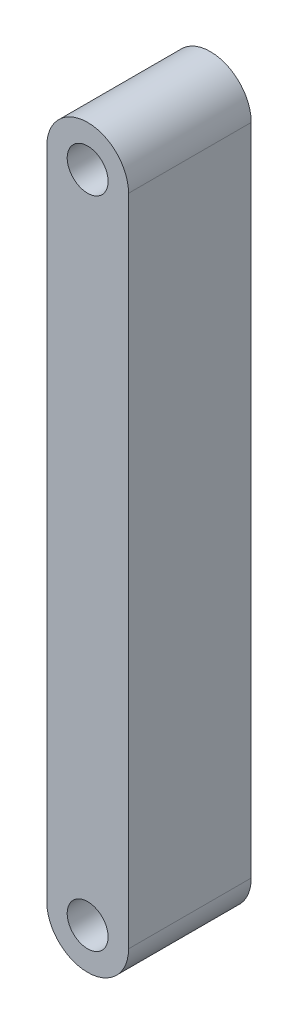
ISO-10303-21;
HEADER;
FILE_DESCRIPTION(('STEP AP214'),'2;1');
FILE_NAME('part.step','',(''),(''),'','','');
FILE_SCHEMA(('AUTOMOTIVE_DESIGN { 1 0 10303 214 1 1 1 1 }'));
ENDSEC;
DATA;
#1=APPLICATION_CONTEXT('core data for automotive mechanical design processes');
#2=APPLICATION_PROTOCOL_DEFINITION('international standard','automotive_design',2000,#1);
#3=PRODUCT_CONTEXT('',#1,'mechanical');
#4=PRODUCT('Part','Part','',(#3));
#5=PRODUCT_RELATED_PRODUCT_CATEGORY('part','',(#4));
#6=PRODUCT_DEFINITION_FORMATION('','',#4);
#7=PRODUCT_DEFINITION_CONTEXT('part definition',#1,'design');
#8=PRODUCT_DEFINITION('design','',#6,#7);
#9=PRODUCT_DEFINITION_SHAPE('','',#8);
#10=(LENGTH_UNIT() NAMED_UNIT(*) SI_UNIT(.MILLI.,.METRE.));
#11=(NAMED_UNIT(*) PLANE_ANGLE_UNIT() SI_UNIT($,.RADIAN.));
#12=(NAMED_UNIT(*) SI_UNIT($,.STERADIAN.) SOLID_ANGLE_UNIT());
#13=UNCERTAINTY_MEASURE_WITH_UNIT(LENGTH_MEASURE(1.E-05),#10,'distance_accuracy_value','');
#14=(GEOMETRIC_REPRESENTATION_CONTEXT(3) GLOBAL_UNCERTAINTY_ASSIGNED_CONTEXT((#13)) GLOBAL_UNIT_ASSIGNED_CONTEXT((#10,
#11,#12)) REPRESENTATION_CONTEXT('',''));
#15=CARTESIAN_POINT('',(0.,0.,0.));
#16=DIRECTION('',(0.,0.,1.));
#17=DIRECTION('',(1.,0.,0.));
#18=AXIS2_PLACEMENT_3D('',#15,#16,#17);
#19=CARTESIAN_POINT('',(0.,-40.,15.));
#20=DIRECTION('',(0.,0.,-1.));
#21=DIRECTION('',(-1.,0.,0.));
#22=AXIS2_PLACEMENT_3D('',#19,#20,#21);
#23=CYLINDRICAL_SURFACE('',#22,5.);
#24=CARTESIAN_POINT('',(0.,-40.,0.));
#25=DIRECTION('',(0.,0.,1.));
#26=DIRECTION('',(1.,0.,0.));
#27=AXIS2_PLACEMENT_3D('',#24,#25,#26);
#28=CIRCLE('',#27,5.);
#29=CARTESIAN_POINT('',(-5.,-40.,0.));
#30=VERTEX_POINT('',#29);
#31=CARTESIAN_POINT('',(5.,-40.,0.));
#32=VERTEX_POINT('',#31);
#33=EDGE_CURVE('E111',#30,#32,#28,.T.);
#34=ORIENTED_EDGE('',*,*,#33,.T.);
#35=DIRECTION('',(0.,0.,-1.));
#36=VECTOR('',#35,1.);
#37=CARTESIAN_POINT('',(5.,-40.,15.));
#38=LINE('',#37,#36);
#39=CARTESIAN_POINT('',(5.,-40.,15.));
#40=VERTEX_POINT('',#39);
#41=EDGE_CURVE('E11',#40,#32,#38,.T.);
#42=ORIENTED_EDGE('',*,*,#41,.F.);
#43=CARTESIAN_POINT('',(0.,-40.,15.));
#44=DIRECTION('',(0.,0.,1.));
#45=DIRECTION('',(1.,0.,0.));
#46=AXIS2_PLACEMENT_3D('',#43,#44,#45);
#47=CIRCLE('',#46,5.);
#48=CARTESIAN_POINT('',(-5.,-40.,15.));
#49=VERTEX_POINT('',#48);
#50=EDGE_CURVE('E84',#49,#40,#47,.T.);
#51=ORIENTED_EDGE('',*,*,#50,.F.);
#52=DIRECTION('',(0.,0.,-1.));
#53=VECTOR('',#52,1.);
#54=CARTESIAN_POINT('',(-5.,-40.,15.));
#55=LINE('',#54,#53);
#56=EDGE_CURVE('E110',#49,#30,#55,.T.);
#57=ORIENTED_EDGE('',*,*,#56,.T.);
#58=EDGE_LOOP('',(#34,#42,#51,#57));
#59=FACE_BOUND('',#58,.T.);
#60=ADVANCED_FACE('F41',(#59),#23,.T.);
#61=CARTESIAN_POINT('',(5.,0.,15.));
#62=DIRECTION('',(1.,0.,0.));
#63=DIRECTION('',(0.,1.,0.));
#64=AXIS2_PLACEMENT_3D('',#61,#62,#63);
#65=PLANE('',#64);
#66=DIRECTION('',(0.,-1.,0.));
#67=VECTOR('',#66,1.);
#68=CARTESIAN_POINT('',(5.,0.,0.));
#69=LINE('',#68,#67);
#70=CARTESIAN_POINT('',(4.99999999999999,40.,0.));
#71=VERTEX_POINT('',#70);
#72=EDGE_CURVE('E94',#71,#32,#69,.T.);
#73=ORIENTED_EDGE('',*,*,#72,.F.);
#74=DIRECTION('',(0.,0.,-1.));
#75=VECTOR('',#74,1.);
#76=CARTESIAN_POINT('',(4.99999999999999,40.,15.));
#77=LINE('',#76,#75);
#78=CARTESIAN_POINT('',(4.99999999999999,40.,15.));
#79=VERTEX_POINT('',#78);
#80=EDGE_CURVE('E50',#79,#71,#77,.T.);
#81=ORIENTED_EDGE('',*,*,#80,.F.);
#82=DIRECTION('',(0.,-1.,0.));
#83=VECTOR('',#82,1.);
#84=CARTESIAN_POINT('',(5.,0.,15.));
#85=LINE('',#84,#83);
#86=EDGE_CURVE('E92',#79,#40,#85,.T.);
#87=ORIENTED_EDGE('',*,*,#86,.T.);
#88=ORIENTED_EDGE('',*,*,#41,.T.);
#89=EDGE_LOOP('',(#73,#81,#87,#88));
#90=FACE_BOUND('',#89,.T.);
#91=ADVANCED_FACE('F91',(#90),#65,.T.);
#92=CARTESIAN_POINT('',(0.,40.,15.));
#93=DIRECTION('',(0.,0.,-1.));
#94=DIRECTION('',(-1.,0.,0.));
#95=AXIS2_PLACEMENT_3D('',#92,#93,#94);
#96=CYLINDRICAL_SURFACE('',#95,5.);
#97=CARTESIAN_POINT('',(0.,40.,0.));
#98=DIRECTION('',(0.,0.,1.));
#99=DIRECTION('',(1.,0.,0.));
#100=AXIS2_PLACEMENT_3D('',#97,#98,#99);
#101=CIRCLE('',#100,5.);
#102=CARTESIAN_POINT('',(-5.00000000000001,40.,0.));
#103=VERTEX_POINT('',#102);
#104=EDGE_CURVE('E73',#71,#103,#101,.T.);
#105=ORIENTED_EDGE('',*,*,#104,.T.);
#106=DIRECTION('',(0.,0.,-1.));
#107=VECTOR('',#106,1.);
#108=CARTESIAN_POINT('',(-5.00000000000001,40.,15.));
#109=LINE('',#108,#107);
#110=CARTESIAN_POINT('',(-5.00000000000001,40.,15.));
#111=VERTEX_POINT('',#110);
#112=EDGE_CURVE('E96',#111,#103,#109,.T.);
#113=ORIENTED_EDGE('',*,*,#112,.F.);
#114=CARTESIAN_POINT('',(0.,40.,15.));
#115=DIRECTION('',(0.,0.,1.));
#116=DIRECTION('',(1.,0.,0.));
#117=AXIS2_PLACEMENT_3D('',#114,#115,#116);
#118=CIRCLE('',#117,5.);
#119=EDGE_CURVE('E97',#79,#111,#118,.T.);
#120=ORIENTED_EDGE('',*,*,#119,.F.);
#121=ORIENTED_EDGE('',*,*,#80,.T.);
#122=EDGE_LOOP('',(#105,#113,#120,#121));
#123=FACE_BOUND('',#122,.T.);
#124=ADVANCED_FACE('F98',(#123),#96,.T.);
#125=CARTESIAN_POINT('',(-5.,0.,15.));
#126=DIRECTION('',(1.,0.,0.));
#127=DIRECTION('',(0.,1.,0.));
#128=AXIS2_PLACEMENT_3D('',#125,#126,#127);
#129=PLANE('',#128);
#130=DIRECTION('',(0.,-1.,0.));
#131=VECTOR('',#130,1.);
#132=CARTESIAN_POINT('',(-5.,0.,0.));
#133=LINE('',#132,#131);
#134=EDGE_CURVE('E79',#103,#30,#133,.T.);
#135=ORIENTED_EDGE('',*,*,#134,.T.);
#136=ORIENTED_EDGE('',*,*,#56,.F.);
#137=DIRECTION('',(0.,-1.,0.));
#138=VECTOR('',#137,1.);
#139=CARTESIAN_POINT('',(-5.,0.,15.));
#140=LINE('',#139,#138);
#141=EDGE_CURVE('E58',#111,#49,#140,.T.);
#142=ORIENTED_EDGE('',*,*,#141,.F.);
#143=ORIENTED_EDGE('',*,*,#112,.T.);
#144=EDGE_LOOP('',(#135,#136,#142,#143));
#145=FACE_BOUND('',#144,.T.);
#146=ADVANCED_FACE('F125',(#145),#129,.F.);
#147=CARTESIAN_POINT('',(0.,0.,15.));
#148=DIRECTION('',(0.,0.,1.));
#149=DIRECTION('',(1.,0.,0.));
#150=AXIS2_PLACEMENT_3D('',#147,#148,#149);
#151=PLANE('',#150);
#152=CARTESIAN_POINT('',(0.,40.,15.));
#153=DIRECTION('',(0.,0.,1.));
#154=DIRECTION('',(1.,0.,0.));
#155=AXIS2_PLACEMENT_3D('',#152,#153,#154);
#156=CIRCLE('',#155,2.5);
#157=CARTESIAN_POINT('',(2.5,40.,15.));
#158=VERTEX_POINT('',#157);
#159=EDGE_CURVE('E161',#158,#158,#156,.T.);
#160=ORIENTED_EDGE('',*,*,#159,.F.);
#161=EDGE_LOOP('',(#160));
#162=FACE_BOUND('',#161,.T.);
#163=CARTESIAN_POINT('',(0.,-40.,15.));
#164=DIRECTION('',(0.,0.,1.));
#165=DIRECTION('',(1.,0.,0.));
#166=AXIS2_PLACEMENT_3D('',#163,#164,#165);
#167=CIRCLE('',#166,2.5);
#168=CARTESIAN_POINT('',(2.5,-40.,15.));
#169=VERTEX_POINT('',#168);
#170=EDGE_CURVE('E169',#169,#169,#167,.T.);
#171=ORIENTED_EDGE('',*,*,#170,.F.);
#172=EDGE_LOOP('',(#171));
#173=FACE_BOUND('',#172,.T.);
#174=ORIENTED_EDGE('',*,*,#50,.T.);
#175=ORIENTED_EDGE('',*,*,#86,.F.);
#176=ORIENTED_EDGE('',*,*,#119,.T.);
#177=ORIENTED_EDGE('',*,*,#141,.T.);
#178=EDGE_LOOP('',(#174,#175,#176,#177));
#179=FACE_BOUND('',#178,.T.);
#180=ADVANCED_FACE('F101',(#162,#173,#179),#151,.T.);
#181=CARTESIAN_POINT('',(0.,0.,0.));
#182=DIRECTION('',(0.,0.,1.));
#183=DIRECTION('',(1.,0.,0.));
#184=AXIS2_PLACEMENT_3D('',#181,#182,#183);
#185=PLANE('',#184);
#186=CARTESIAN_POINT('',(0.,40.,0.));
#187=DIRECTION('',(0.,0.,1.));
#188=DIRECTION('',(1.,0.,0.));
#189=AXIS2_PLACEMENT_3D('',#186,#187,#188);
#190=CIRCLE('',#189,2.5);
#191=CARTESIAN_POINT('',(2.5,40.,0.));
#192=VERTEX_POINT('',#191);
#193=EDGE_CURVE('E115',#192,#192,#190,.F.);
#194=ORIENTED_EDGE('',*,*,#193,.F.);
#195=EDGE_LOOP('',(#194));
#196=FACE_BOUND('',#195,.T.);
#197=CARTESIAN_POINT('',(0.,-40.,0.));
#198=DIRECTION('',(0.,0.,1.));
#199=DIRECTION('',(1.,0.,0.));
#200=AXIS2_PLACEMENT_3D('',#197,#198,#199);
#201=CIRCLE('',#200,2.5);
#202=CARTESIAN_POINT('',(2.5,-40.,0.));
#203=VERTEX_POINT('',#202);
#204=EDGE_CURVE('E163',#203,#203,#201,.F.);
#205=ORIENTED_EDGE('',*,*,#204,.F.);
#206=EDGE_LOOP('',(#205));
#207=FACE_BOUND('',#206,.T.);
#208=ORIENTED_EDGE('',*,*,#33,.F.);
#209=ORIENTED_EDGE('',*,*,#134,.F.);
#210=ORIENTED_EDGE('',*,*,#104,.F.);
#211=ORIENTED_EDGE('',*,*,#72,.T.);
#212=EDGE_LOOP('',(#208,#209,#210,#211));
#213=FACE_BOUND('',#212,.T.);
#214=ADVANCED_FACE('F128',(#196,#207,#213),#185,.F.);
#215=CARTESIAN_POINT('',(0.,-40.,-7.07106781186548));
#216=DIRECTION('',(0.,0.,1.));
#217=DIRECTION('',(1.,0.,0.));
#218=AXIS2_PLACEMENT_3D('',#215,#216,#217);
#219=CYLINDRICAL_SURFACE('',#218,2.5);
#220=ORIENTED_EDGE('',*,*,#204,.T.);
#221=EDGE_LOOP('',(#220));
#222=FACE_BOUND('',#221,.T.);
#223=ORIENTED_EDGE('',*,*,#170,.T.);
#224=EDGE_LOOP('',(#223));
#225=FACE_BOUND('',#224,.T.);
#226=ADVANCED_FACE('F143',(#222,#225),#219,.F.);
#227=CARTESIAN_POINT('',(0.,40.,-7.07106781186548));
#228=DIRECTION('',(0.,0.,1.));
#229=DIRECTION('',(1.,0.,0.));
#230=AXIS2_PLACEMENT_3D('',#227,#228,#229);
#231=CYLINDRICAL_SURFACE('',#230,2.5);
#232=ORIENTED_EDGE('',*,*,#193,.T.);
#233=EDGE_LOOP('',(#232));
#234=FACE_BOUND('',#233,.T.);
#235=ORIENTED_EDGE('',*,*,#159,.T.);
#236=EDGE_LOOP('',(#235));
#237=FACE_BOUND('',#236,.T.);
#238=ADVANCED_FACE('F150',(#234,#237),#231,.F.);
#239=CLOSED_SHELL('',(#60,#91,#124,#146,#180,#214,#226,#238));
#240=MANIFOLD_SOLID_BREP('B2',#239);
#241=ADVANCED_BREP_SHAPE_REPRESENTATION('',(#18,#240),#14);
#242=SHAPE_DEFINITION_REPRESENTATION(#9,#241);
ENDSEC;
END-ISO-10303-21;
